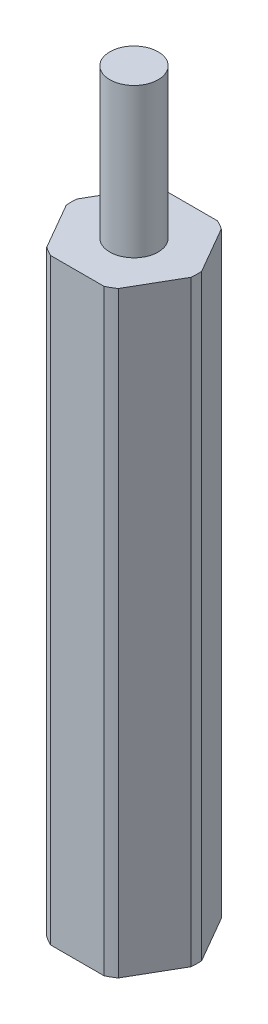
ISO-10303-21;
HEADER;
FILE_DESCRIPTION(('STEP AP214'),'2;1');
FILE_NAME('part.step','',(''),(''),'','','');
FILE_SCHEMA(('AUTOMOTIVE_DESIGN { 1 0 10303 214 1 1 1 1 }'));
ENDSEC;
DATA;
#1=APPLICATION_CONTEXT('core data for automotive mechanical design processes');
#2=APPLICATION_PROTOCOL_DEFINITION('international standard','automotive_design',2000,#1);
#3=PRODUCT_CONTEXT('',#1,'mechanical');
#4=PRODUCT('Part','Part','',(#3));
#5=PRODUCT_RELATED_PRODUCT_CATEGORY('part','',(#4));
#6=PRODUCT_DEFINITION_FORMATION('','',#4);
#7=PRODUCT_DEFINITION_CONTEXT('part definition',#1,'design');
#8=PRODUCT_DEFINITION('design','',#6,#7);
#9=PRODUCT_DEFINITION_SHAPE('','',#8);
#10=(LENGTH_UNIT() NAMED_UNIT(*) SI_UNIT(.MILLI.,.METRE.));
#11=(NAMED_UNIT(*) PLANE_ANGLE_UNIT() SI_UNIT($,.RADIAN.));
#12=(NAMED_UNIT(*) SI_UNIT($,.STERADIAN.) SOLID_ANGLE_UNIT());
#13=UNCERTAINTY_MEASURE_WITH_UNIT(LENGTH_MEASURE(1.E-05),#10,'distance_accuracy_value','');
#14=(GEOMETRIC_REPRESENTATION_CONTEXT(3) GLOBAL_UNCERTAINTY_ASSIGNED_CONTEXT((#13)) GLOBAL_UNIT_ASSIGNED_CONTEXT((#10,
#11,#12)) REPRESENTATION_CONTEXT('',''));
#15=CARTESIAN_POINT('',(0.,0.,0.));
#16=DIRECTION('',(0.,0.,1.));
#17=DIRECTION('',(1.,0.,0.));
#18=AXIS2_PLACEMENT_3D('',#15,#16,#17);
#19=CARTESIAN_POINT('',(0.,25.4,0.));
#20=DIRECTION('',(0.,-1.,0.));
#21=DIRECTION('',(0.,0.,-1.));
#22=AXIS2_PLACEMENT_3D('',#19,#20,#21);
#23=CYLINDRICAL_SURFACE('',#22,2.667);
#24=CARTESIAN_POINT('',(0.,0.,0.));
#25=DIRECTION('',(0.,1.,0.));
#26=DIRECTION('',(0.,0.,1.));
#27=AXIS2_PLACEMENT_3D('',#24,#25,#26);
#28=CIRCLE('',#27,2.667);
#29=CARTESIAN_POINT('',(-1.13592253256989,0.,-2.413));
#30=VERTEX_POINT('',#29);
#31=CARTESIAN_POINT('',(-1.52175803304691,0.,-2.19023776993668));
#32=VERTEX_POINT('',#31);
#33=EDGE_CURVE('E166',#30,#32,#28,.T.);
#34=ORIENTED_EDGE('',*,*,#33,.T.);
#35=DIRECTION('',(0.,-1.,0.));
#36=VECTOR('',#35,1.);
#37=CARTESIAN_POINT('',(-1.52175803304691,25.4,-2.19023776993668));
#38=LINE('',#37,#36);
#39=CARTESIAN_POINT('',(-1.52175803304691,25.4,-2.19023776993668));
#40=VERTEX_POINT('',#39);
#41=EDGE_CURVE('E42',#40,#32,#38,.T.);
#42=ORIENTED_EDGE('',*,*,#41,.F.);
#43=CARTESIAN_POINT('',(0.,25.4,0.));
#44=DIRECTION('',(0.,1.,0.));
#45=DIRECTION('',(0.,0.,1.));
#46=AXIS2_PLACEMENT_3D('',#43,#44,#45);
#47=CIRCLE('',#46,2.667);
#48=CARTESIAN_POINT('',(-1.13592253256989,25.4,-2.413));
#49=VERTEX_POINT('',#48);
#50=EDGE_CURVE('E201',#49,#40,#47,.T.);
#51=ORIENTED_EDGE('',*,*,#50,.F.);
#52=DIRECTION('',(0.,-1.,0.));
#53=VECTOR('',#52,1.);
#54=CARTESIAN_POINT('',(-1.13592253256989,25.4,-2.413));
#55=LINE('',#54,#53);
#56=EDGE_CURVE('E162',#49,#30,#55,.T.);
#57=ORIENTED_EDGE('',*,*,#56,.T.);
#58=EDGE_LOOP('',(#34,#42,#51,#57));
#59=FACE_BOUND('',#58,.T.);
#60=ADVANCED_FACE('F39',(#59),#23,.T.);
#61=CARTESIAN_POINT('',(-2.6576805656168,25.4,-0.222762230063314));
#62=DIRECTION('',(0.866025403784439,0.,0.499999999999999));
#63=DIRECTION('',(0.499999999999999,0.,-0.866025403784439));
#64=AXIS2_PLACEMENT_3D('',#61,#62,#63);
#65=PLANE('',#64);
#66=DIRECTION('',(-0.499999999999999,0.,0.866025403784439));
#67=VECTOR('',#66,1.);
#68=CARTESIAN_POINT('',(-2.6576805656168,0.,-0.222762230063314));
#69=LINE('',#68,#67);
#70=CARTESIAN_POINT('',(-2.6576805656168,0.,-0.222762230063315));
#71=VERTEX_POINT('',#70);
#72=EDGE_CURVE('E170',#32,#71,#69,.T.);
#73=ORIENTED_EDGE('',*,*,#72,.T.);
#74=DIRECTION('',(0.,-1.,0.));
#75=VECTOR('',#74,1.);
#76=CARTESIAN_POINT('',(-2.6576805656168,25.4,-0.222762230063315));
#77=LINE('',#76,#75);
#78=CARTESIAN_POINT('',(-2.6576805656168,25.4,-0.222762230063315));
#79=VERTEX_POINT('',#78);
#80=EDGE_CURVE('E231',#79,#71,#77,.T.);
#81=ORIENTED_EDGE('',*,*,#80,.F.);
#82=DIRECTION('',(-0.499999999999999,0.,0.866025403784439));
#83=VECTOR('',#82,1.);
#84=CARTESIAN_POINT('',(-2.6576805656168,25.4,-0.222762230063314));
#85=LINE('',#84,#83);
#86=EDGE_CURVE('E113',#40,#79,#85,.T.);
#87=ORIENTED_EDGE('',*,*,#86,.F.);
#88=ORIENTED_EDGE('',*,*,#41,.T.);
#89=EDGE_LOOP('',(#73,#81,#87,#88));
#90=FACE_BOUND('',#89,.T.);
#91=ADVANCED_FACE('F239',(#90),#65,.F.);
#92=CARTESIAN_POINT('',(0.,25.4,0.));
#93=DIRECTION('',(0.,-1.,0.));
#94=DIRECTION('',(0.,0.,-1.));
#95=AXIS2_PLACEMENT_3D('',#92,#93,#94);
#96=CYLINDRICAL_SURFACE('',#95,2.667);
#97=CARTESIAN_POINT('',(0.,0.,0.));
#98=DIRECTION('',(0.,1.,0.));
#99=DIRECTION('',(0.,0.,1.));
#100=AXIS2_PLACEMENT_3D('',#97,#98,#99);
#101=CIRCLE('',#100,2.667);
#102=CARTESIAN_POINT('',(-2.6576805656168,0.,0.222762230063318));
#103=VERTEX_POINT('',#102);
#104=EDGE_CURVE('E174',#71,#103,#101,.T.);
#105=ORIENTED_EDGE('',*,*,#104,.T.);
#106=DIRECTION('',(0.,-1.,0.));
#107=VECTOR('',#106,1.);
#108=CARTESIAN_POINT('',(-2.6576805656168,25.4,0.222762230063318));
#109=LINE('',#108,#107);
#110=CARTESIAN_POINT('',(-2.6576805656168,25.4,0.222762230063318));
#111=VERTEX_POINT('',#110);
#112=EDGE_CURVE('E228',#111,#103,#109,.T.);
#113=ORIENTED_EDGE('',*,*,#112,.F.);
#114=CARTESIAN_POINT('',(0.,25.4,0.));
#115=DIRECTION('',(0.,1.,0.));
#116=DIRECTION('',(0.,0.,1.));
#117=AXIS2_PLACEMENT_3D('',#114,#115,#116);
#118=CIRCLE('',#117,2.667);
#119=EDGE_CURVE('E257',#79,#111,#118,.T.);
#120=ORIENTED_EDGE('',*,*,#119,.F.);
#121=ORIENTED_EDGE('',*,*,#80,.T.);
#122=EDGE_LOOP('',(#105,#113,#120,#121));
#123=FACE_BOUND('',#122,.T.);
#124=ADVANCED_FACE('F248',(#123),#96,.T.);
#125=CARTESIAN_POINT('',(-1.5217580330469,25.4,2.19023776993668));
#126=DIRECTION('',(0.866025403784438,0.,-0.5));
#127=DIRECTION('',(-0.500000000000001,0.,-0.866025403784438));
#128=AXIS2_PLACEMENT_3D('',#125,#126,#127);
#129=PLANE('',#128);
#130=DIRECTION('',(0.5,0.,0.866025403784438));
#131=VECTOR('',#130,1.);
#132=CARTESIAN_POINT('',(-1.5217580330469,0.,2.19023776993668));
#133=LINE('',#132,#131);
#134=CARTESIAN_POINT('',(-1.5217580330469,0.,2.19023776993668));
#135=VERTEX_POINT('',#134);
#136=EDGE_CURVE('E177',#103,#135,#133,.T.);
#137=ORIENTED_EDGE('',*,*,#136,.T.);
#138=DIRECTION('',(0.,-1.,0.));
#139=VECTOR('',#138,1.);
#140=CARTESIAN_POINT('',(-1.5217580330469,25.4,2.19023776993668));
#141=LINE('',#140,#139);
#142=CARTESIAN_POINT('',(-1.5217580330469,25.4,2.19023776993668));
#143=VERTEX_POINT('',#142);
#144=EDGE_CURVE('E224',#143,#135,#141,.T.);
#145=ORIENTED_EDGE('',*,*,#144,.F.);
#146=DIRECTION('',(0.5,0.,0.866025403784438));
#147=VECTOR('',#146,1.);
#148=CARTESIAN_POINT('',(-1.5217580330469,25.4,2.19023776993668));
#149=LINE('',#148,#147);
#150=EDGE_CURVE('E253',#111,#143,#149,.T.);
#151=ORIENTED_EDGE('',*,*,#150,.F.);
#152=ORIENTED_EDGE('',*,*,#112,.T.);
#153=EDGE_LOOP('',(#137,#145,#151,#152));
#154=FACE_BOUND('',#153,.T.);
#155=ADVANCED_FACE('F251',(#154),#129,.F.);
#156=CARTESIAN_POINT('',(0.,25.4,0.));
#157=DIRECTION('',(0.,-1.,0.));
#158=DIRECTION('',(0.,0.,-1.));
#159=AXIS2_PLACEMENT_3D('',#156,#157,#158);
#160=CYLINDRICAL_SURFACE('',#159,2.667);
#161=CARTESIAN_POINT('',(0.,0.,0.));
#162=DIRECTION('',(0.,1.,0.));
#163=DIRECTION('',(0.,0.,1.));
#164=AXIS2_PLACEMENT_3D('',#161,#162,#163);
#165=CIRCLE('',#164,2.667);
#166=CARTESIAN_POINT('',(-1.13592253256989,0.,2.413));
#167=VERTEX_POINT('',#166);
#168=EDGE_CURVE('E180',#135,#167,#165,.T.);
#169=ORIENTED_EDGE('',*,*,#168,.T.);
#170=DIRECTION('',(0.,-1.,0.));
#171=VECTOR('',#170,1.);
#172=CARTESIAN_POINT('',(-1.13592253256989,25.4,2.413));
#173=LINE('',#172,#171);
#174=CARTESIAN_POINT('',(-1.13592253256989,25.4,2.413));
#175=VERTEX_POINT('',#174);
#176=EDGE_CURVE('E220',#175,#167,#173,.T.);
#177=ORIENTED_EDGE('',*,*,#176,.F.);
#178=CARTESIAN_POINT('',(0.,25.4,0.));
#179=DIRECTION('',(0.,1.,0.));
#180=DIRECTION('',(0.,0.,1.));
#181=AXIS2_PLACEMENT_3D('',#178,#179,#180);
#182=CIRCLE('',#181,2.667);
#183=EDGE_CURVE('E256',#143,#175,#182,.T.);
#184=ORIENTED_EDGE('',*,*,#183,.F.);
#185=ORIENTED_EDGE('',*,*,#144,.T.);
#186=EDGE_LOOP('',(#169,#177,#184,#185));
#187=FACE_BOUND('',#186,.T.);
#188=ADVANCED_FACE('F294',(#187),#160,.T.);
#189=CARTESIAN_POINT('',(1.13592253256989,25.4,2.413));
#190=DIRECTION('',(0.,0.,-1.));
#191=DIRECTION('',(-1.,0.,0.));
#192=AXIS2_PLACEMENT_3D('',#189,#190,#191);
#193=PLANE('',#192);
#194=DIRECTION('',(1.,0.,0.));
#195=VECTOR('',#194,1.);
#196=CARTESIAN_POINT('',(1.13592253256989,0.,2.413));
#197=LINE('',#196,#195);
#198=CARTESIAN_POINT('',(1.13592253256989,0.,2.413));
#199=VERTEX_POINT('',#198);
#200=EDGE_CURVE('E183',#167,#199,#197,.T.);
#201=ORIENTED_EDGE('',*,*,#200,.T.);
#202=DIRECTION('',(0.,-1.,0.));
#203=VECTOR('',#202,1.);
#204=CARTESIAN_POINT('',(1.13592253256989,25.4,2.413));
#205=LINE('',#204,#203);
#206=CARTESIAN_POINT('',(1.13592253256989,25.4,2.413));
#207=VERTEX_POINT('',#206);
#208=EDGE_CURVE('E216',#207,#199,#205,.T.);
#209=ORIENTED_EDGE('',*,*,#208,.F.);
#210=DIRECTION('',(1.,0.,0.));
#211=VECTOR('',#210,1.);
#212=CARTESIAN_POINT('',(1.13592253256989,25.4,2.413));
#213=LINE('',#212,#211);
#214=EDGE_CURVE('E261',#175,#207,#213,.T.);
#215=ORIENTED_EDGE('',*,*,#214,.F.);
#216=ORIENTED_EDGE('',*,*,#176,.T.);
#217=EDGE_LOOP('',(#201,#209,#215,#216));
#218=FACE_BOUND('',#217,.T.);
#219=ADVANCED_FACE('F291',(#218),#193,.F.);
#220=CARTESIAN_POINT('',(0.,25.4,0.));
#221=DIRECTION('',(0.,-1.,0.));
#222=DIRECTION('',(0.,0.,-1.));
#223=AXIS2_PLACEMENT_3D('',#220,#221,#222);
#224=CYLINDRICAL_SURFACE('',#223,2.667);
#225=CARTESIAN_POINT('',(0.,0.,0.));
#226=DIRECTION('',(0.,1.,0.));
#227=DIRECTION('',(0.,0.,1.));
#228=AXIS2_PLACEMENT_3D('',#225,#226,#227);
#229=CIRCLE('',#228,2.667);
#230=CARTESIAN_POINT('',(1.5217580330469,0.,2.19023776993668));
#231=VERTEX_POINT('',#230);
#232=EDGE_CURVE('E186',#199,#231,#229,.T.);
#233=ORIENTED_EDGE('',*,*,#232,.T.);
#234=DIRECTION('',(0.,-1.,0.));
#235=VECTOR('',#234,1.);
#236=CARTESIAN_POINT('',(1.5217580330469,25.4,2.19023776993668));
#237=LINE('',#236,#235);
#238=CARTESIAN_POINT('',(1.5217580330469,25.4,2.19023776993668));
#239=VERTEX_POINT('',#238);
#240=EDGE_CURVE('E212',#239,#231,#237,.T.);
#241=ORIENTED_EDGE('',*,*,#240,.F.);
#242=CARTESIAN_POINT('',(0.,25.4,0.));
#243=DIRECTION('',(0.,1.,0.));
#244=DIRECTION('',(0.,0.,1.));
#245=AXIS2_PLACEMENT_3D('',#242,#243,#244);
#246=CIRCLE('',#245,2.667);
#247=EDGE_CURVE('E268',#207,#239,#246,.T.);
#248=ORIENTED_EDGE('',*,*,#247,.F.);
#249=ORIENTED_EDGE('',*,*,#208,.T.);
#250=EDGE_LOOP('',(#233,#241,#248,#249));
#251=FACE_BOUND('',#250,.T.);
#252=ADVANCED_FACE('F287',(#251),#224,.T.);
#253=CARTESIAN_POINT('',(2.6576805656168,25.4,0.222762230063316));
#254=DIRECTION('',(-0.866025403784439,0.,-0.5));
#255=DIRECTION('',(-0.5,0.,0.866025403784439));
#256=AXIS2_PLACEMENT_3D('',#253,#254,#255);
#257=PLANE('',#256);
#258=DIRECTION('',(0.5,0.,-0.866025403784439));
#259=VECTOR('',#258,1.);
#260=CARTESIAN_POINT('',(2.6576805656168,0.,0.222762230063316));
#261=LINE('',#260,#259);
#262=CARTESIAN_POINT('',(2.6576805656168,0.,0.222762230063316));
#263=VERTEX_POINT('',#262);
#264=EDGE_CURVE('E189',#231,#263,#261,.T.);
#265=ORIENTED_EDGE('',*,*,#264,.T.);
#266=DIRECTION('',(0.,-1.,0.));
#267=VECTOR('',#266,1.);
#268=CARTESIAN_POINT('',(2.6576805656168,25.4,0.222762230063316));
#269=LINE('',#268,#267);
#270=CARTESIAN_POINT('',(2.6576805656168,25.4,0.222762230063316));
#271=VERTEX_POINT('',#270);
#272=EDGE_CURVE('E208',#271,#263,#269,.T.);
#273=ORIENTED_EDGE('',*,*,#272,.F.);
#274=DIRECTION('',(0.5,0.,-0.866025403784439));
#275=VECTOR('',#274,1.);
#276=CARTESIAN_POINT('',(2.6576805656168,25.4,0.222762230063316));
#277=LINE('',#276,#275);
#278=EDGE_CURVE('E271',#239,#271,#277,.T.);
#279=ORIENTED_EDGE('',*,*,#278,.F.);
#280=ORIENTED_EDGE('',*,*,#240,.T.);
#281=EDGE_LOOP('',(#265,#273,#279,#280));
#282=FACE_BOUND('',#281,.T.);
#283=ADVANCED_FACE('F279',(#282),#257,.F.);
#284=CARTESIAN_POINT('',(0.,25.4,0.));
#285=DIRECTION('',(0.,-1.,0.));
#286=DIRECTION('',(0.,0.,-1.));
#287=AXIS2_PLACEMENT_3D('',#284,#285,#286);
#288=CYLINDRICAL_SURFACE('',#287,2.667);
#289=CARTESIAN_POINT('',(0.,0.,0.));
#290=DIRECTION('',(0.,1.,0.));
#291=DIRECTION('',(0.,0.,1.));
#292=AXIS2_PLACEMENT_3D('',#289,#290,#291);
#293=CIRCLE('',#292,2.667);
#294=CARTESIAN_POINT('',(2.6576805656168,0.,-0.222762230063317));
#295=VERTEX_POINT('',#294);
#296=EDGE_CURVE('E192',#263,#295,#293,.T.);
#297=ORIENTED_EDGE('',*,*,#296,.T.);
#298=DIRECTION('',(0.,-1.,0.));
#299=VECTOR('',#298,1.);
#300=CARTESIAN_POINT('',(2.6576805656168,25.4,-0.222762230063317));
#301=LINE('',#300,#299);
#302=CARTESIAN_POINT('',(2.6576805656168,25.4,-0.222762230063317));
#303=VERTEX_POINT('',#302);
#304=EDGE_CURVE('E155',#303,#295,#301,.T.);
#305=ORIENTED_EDGE('',*,*,#304,.F.);
#306=CARTESIAN_POINT('',(0.,25.4,0.));
#307=DIRECTION('',(0.,1.,0.));
#308=DIRECTION('',(0.,0.,1.));
#309=AXIS2_PLACEMENT_3D('',#306,#307,#308);
#310=CIRCLE('',#309,2.667);
#311=EDGE_CURVE('E144',#271,#303,#310,.T.);
#312=ORIENTED_EDGE('',*,*,#311,.F.);
#313=ORIENTED_EDGE('',*,*,#272,.T.);
#314=EDGE_LOOP('',(#297,#305,#312,#313));
#315=FACE_BOUND('',#314,.T.);
#316=ADVANCED_FACE('F283',(#315),#288,.T.);
#317=CARTESIAN_POINT('',(1.5217580330469,25.4,-2.19023776993668));
#318=DIRECTION('',(-0.866025403784439,0.,0.5));
#319=DIRECTION('',(0.5,0.,0.866025403784439));
#320=AXIS2_PLACEMENT_3D('',#317,#318,#319);
#321=PLANE('',#320);
#322=DIRECTION('',(-0.5,0.,-0.866025403784439));
#323=VECTOR('',#322,1.);
#324=CARTESIAN_POINT('',(1.5217580330469,0.,-2.19023776993668));
#325=LINE('',#324,#323);
#326=CARTESIAN_POINT('',(1.5217580330469,0.,-2.19023776993668));
#327=VERTEX_POINT('',#326);
#328=EDGE_CURVE('E153',#295,#327,#325,.T.);
#329=ORIENTED_EDGE('',*,*,#328,.T.);
#330=DIRECTION('',(0.,-1.,0.));
#331=VECTOR('',#330,1.);
#332=CARTESIAN_POINT('',(1.5217580330469,25.4,-2.19023776993668));
#333=LINE('',#332,#331);
#334=CARTESIAN_POINT('',(1.5217580330469,25.4,-2.19023776993668));
#335=VERTEX_POINT('',#334);
#336=EDGE_CURVE('E150',#335,#327,#333,.T.);
#337=ORIENTED_EDGE('',*,*,#336,.F.);
#338=DIRECTION('',(-0.5,0.,-0.866025403784439));
#339=VECTOR('',#338,1.);
#340=CARTESIAN_POINT('',(1.5217580330469,25.4,-2.19023776993668));
#341=LINE('',#340,#339);
#342=EDGE_CURVE('E138',#303,#335,#341,.T.);
#343=ORIENTED_EDGE('',*,*,#342,.F.);
#344=ORIENTED_EDGE('',*,*,#304,.T.);
#345=EDGE_LOOP('',(#329,#337,#343,#344));
#346=FACE_BOUND('',#345,.T.);
#347=ADVANCED_FACE('F151',(#346),#321,.F.);
#348=CARTESIAN_POINT('',(0.,25.4,0.));
#349=DIRECTION('',(0.,-1.,0.));
#350=DIRECTION('',(0.,0.,-1.));
#351=AXIS2_PLACEMENT_3D('',#348,#349,#350);
#352=CYLINDRICAL_SURFACE('',#351,2.667);
#353=CARTESIAN_POINT('',(0.,0.,0.));
#354=DIRECTION('',(0.,1.,0.));
#355=DIRECTION('',(0.,0.,1.));
#356=AXIS2_PLACEMENT_3D('',#353,#354,#355);
#357=CIRCLE('',#356,2.667);
#358=CARTESIAN_POINT('',(1.13592253256989,0.,-2.413));
#359=VERTEX_POINT('',#358);
#360=EDGE_CURVE('E98',#327,#359,#357,.T.);
#361=ORIENTED_EDGE('',*,*,#360,.T.);
#362=DIRECTION('',(0.,-1.,0.));
#363=VECTOR('',#362,1.);
#364=CARTESIAN_POINT('',(1.13592253256989,25.4,-2.413));
#365=LINE('',#364,#363);
#366=CARTESIAN_POINT('',(1.13592253256989,25.4,-2.413));
#367=VERTEX_POINT('',#366);
#368=EDGE_CURVE('E156',#367,#359,#365,.T.);
#369=ORIENTED_EDGE('',*,*,#368,.F.);
#370=CARTESIAN_POINT('',(0.,25.4,0.));
#371=DIRECTION('',(0.,1.,0.));
#372=DIRECTION('',(0.,0.,1.));
#373=AXIS2_PLACEMENT_3D('',#370,#371,#372);
#374=CIRCLE('',#373,2.667);
#375=EDGE_CURVE('E142',#335,#367,#374,.T.);
#376=ORIENTED_EDGE('',*,*,#375,.F.);
#377=ORIENTED_EDGE('',*,*,#336,.T.);
#378=EDGE_LOOP('',(#361,#369,#376,#377));
#379=FACE_BOUND('',#378,.T.);
#380=ADVANCED_FACE('F158',(#379),#352,.T.);
#381=CARTESIAN_POINT('',(-1.13592253256989,25.4,-2.413));
#382=DIRECTION('',(0.,0.,1.));
#383=DIRECTION('',(1.,0.,0.));
#384=AXIS2_PLACEMENT_3D('',#381,#382,#383);
#385=PLANE('',#384);
#386=DIRECTION('',(-1.,0.,0.));
#387=VECTOR('',#386,1.);
#388=CARTESIAN_POINT('',(-1.13592253256989,0.,-2.413));
#389=LINE('',#388,#387);
#390=EDGE_CURVE('E104',#359,#30,#389,.T.);
#391=ORIENTED_EDGE('',*,*,#390,.T.);
#392=ORIENTED_EDGE('',*,*,#56,.F.);
#393=DIRECTION('',(-1.,0.,0.));
#394=VECTOR('',#393,1.);
#395=CARTESIAN_POINT('',(-1.13592253256989,25.4,-2.413));
#396=LINE('',#395,#394);
#397=EDGE_CURVE('E57',#367,#49,#396,.T.);
#398=ORIENTED_EDGE('',*,*,#397,.F.);
#399=ORIENTED_EDGE('',*,*,#368,.T.);
#400=EDGE_LOOP('',(#391,#392,#398,#399));
#401=FACE_BOUND('',#400,.T.);
#402=ADVANCED_FACE('F368',(#401),#385,.F.);
#403=CARTESIAN_POINT('',(0.,25.4,0.));
#404=DIRECTION('',(0.,1.,0.));
#405=DIRECTION('',(0.,0.,1.));
#406=AXIS2_PLACEMENT_3D('',#403,#404,#405);
#407=PLANE('',#406);
#408=CARTESIAN_POINT('',(0.,25.4,0.));
#409=DIRECTION('',(0.,1.,0.));
#410=DIRECTION('',(0.,0.,1.));
#411=AXIS2_PLACEMENT_3D('',#408,#409,#410);
#412=CIRCLE('',#411,1.0287);
#413=CARTESIAN_POINT('',(0.,25.4,1.0287));
#414=VERTEX_POINT('',#413);
#415=EDGE_CURVE('E11',#414,#414,#412,.T.);
#416=ORIENTED_EDGE('',*,*,#415,.F.);
#417=EDGE_LOOP('',(#416));
#418=FACE_BOUND('',#417,.T.);
#419=ORIENTED_EDGE('',*,*,#50,.T.);
#420=ORIENTED_EDGE('',*,*,#86,.T.);
#421=ORIENTED_EDGE('',*,*,#119,.T.);
#422=ORIENTED_EDGE('',*,*,#150,.T.);
#423=ORIENTED_EDGE('',*,*,#183,.T.);
#424=ORIENTED_EDGE('',*,*,#214,.T.);
#425=ORIENTED_EDGE('',*,*,#247,.T.);
#426=ORIENTED_EDGE('',*,*,#278,.T.);
#427=ORIENTED_EDGE('',*,*,#311,.T.);
#428=ORIENTED_EDGE('',*,*,#342,.T.);
#429=ORIENTED_EDGE('',*,*,#375,.T.);
#430=ORIENTED_EDGE('',*,*,#397,.T.);
#431=EDGE_LOOP('',(#419,#420,#421,#422,#423,#424,#425,#426,#427,#428,#429,#430));
#432=FACE_BOUND('',#431,.T.);
#433=ADVANCED_FACE('F140',(#418,#432),#407,.T.);
#434=CARTESIAN_POINT('',(0.,0.,0.));
#435=DIRECTION('',(0.,1.,0.));
#436=DIRECTION('',(0.,0.,1.));
#437=AXIS2_PLACEMENT_3D('',#434,#435,#436);
#438=PLANE('',#437);
#439=CARTESIAN_POINT('',(0.,0.,0.));
#440=DIRECTION('',(0.,-1.,0.));
#441=DIRECTION('',(0.,0.,-1.));
#442=AXIS2_PLACEMENT_3D('',#439,#440,#441);
#443=CIRCLE('',#442,1.0287);
#444=CARTESIAN_POINT('',(0.,0.,-1.0287));
#445=VERTEX_POINT('',#444);
#446=EDGE_CURVE('E442',#445,#445,#443,.T.);
#447=ORIENTED_EDGE('',*,*,#446,.F.);
#448=EDGE_LOOP('',(#447));
#449=FACE_BOUND('',#448,.T.);
#450=ORIENTED_EDGE('',*,*,#33,.F.);
#451=ORIENTED_EDGE('',*,*,#390,.F.);
#452=ORIENTED_EDGE('',*,*,#360,.F.);
#453=ORIENTED_EDGE('',*,*,#328,.F.);
#454=ORIENTED_EDGE('',*,*,#296,.F.);
#455=ORIENTED_EDGE('',*,*,#264,.F.);
#456=ORIENTED_EDGE('',*,*,#232,.F.);
#457=ORIENTED_EDGE('',*,*,#200,.F.);
#458=ORIENTED_EDGE('',*,*,#168,.F.);
#459=ORIENTED_EDGE('',*,*,#136,.F.);
#460=ORIENTED_EDGE('',*,*,#104,.F.);
#461=ORIENTED_EDGE('',*,*,#72,.F.);
#462=EDGE_LOOP('',(#450,#451,#452,#453,#454,#455,#456,#457,#458,#459,#460,#461));
#463=FACE_BOUND('',#462,.T.);
#464=ADVANCED_FACE('F244',(#449,#463),#438,.F.);
#465=CARTESIAN_POINT('',(0.,31.75,0.));
#466=DIRECTION('',(0.,-1.,0.));
#467=DIRECTION('',(0.,0.,-1.));
#468=AXIS2_PLACEMENT_3D('',#465,#466,#467);
#469=CYLINDRICAL_SURFACE('',#468,1.0287);
#470=CARTESIAN_POINT('',(0.,31.75,0.));
#471=DIRECTION('',(0.,1.,0.));
#472=DIRECTION('',(0.,0.,1.));
#473=AXIS2_PLACEMENT_3D('',#470,#471,#472);
#474=CIRCLE('',#473,1.0287);
#475=CARTESIAN_POINT('',(0.,31.75,1.0287));
#476=VERTEX_POINT('',#475);
#477=EDGE_CURVE('E171',#476,#476,#474,.T.);
#478=ORIENTED_EDGE('',*,*,#477,.F.);
#479=EDGE_LOOP('',(#478));
#480=FACE_BOUND('',#479,.T.);
#481=ORIENTED_EDGE('',*,*,#415,.T.);
#482=EDGE_LOOP('',(#481));
#483=FACE_BOUND('',#482,.T.);
#484=ADVANCED_FACE('F392',(#480,#483),#469,.T.);
#485=CARTESIAN_POINT('',(0.,31.75,0.));
#486=DIRECTION('',(0.,1.,0.));
#487=DIRECTION('',(0.,0.,1.));
#488=AXIS2_PLACEMENT_3D('',#485,#486,#487);
#489=PLANE('',#488);
#490=ORIENTED_EDGE('',*,*,#477,.T.);
#491=EDGE_LOOP('',(#490));
#492=FACE_BOUND('',#491,.T.);
#493=ADVANCED_FACE('F397',(#492),#489,.T.);
#494=CARTESIAN_POINT('',(0.,6.35,0.));
#495=DIRECTION('',(0.,-1.,0.));
#496=DIRECTION('',(0.,0.,-1.));
#497=AXIS2_PLACEMENT_3D('',#494,#495,#496);
#498=CYLINDRICAL_SURFACE('',#497,1.0287);
#499=CARTESIAN_POINT('',(0.,6.35,0.));
#500=DIRECTION('',(0.,-1.,0.));
#501=DIRECTION('',(0.,0.,-1.));
#502=AXIS2_PLACEMENT_3D('',#499,#500,#501);
#503=CIRCLE('',#502,1.0287);
#504=CARTESIAN_POINT('',(0.,6.35,-1.0287));
#505=VERTEX_POINT('',#504);
#506=EDGE_CURVE('E440',#505,#505,#503,.T.);
#507=ORIENTED_EDGE('',*,*,#506,.F.);
#508=EDGE_LOOP('',(#507));
#509=FACE_BOUND('',#508,.T.);
#510=ORIENTED_EDGE('',*,*,#446,.T.);
#511=EDGE_LOOP('',(#510));
#512=FACE_BOUND('',#511,.T.);
#513=ADVANCED_FACE('F407',(#509,#512),#498,.F.);
#514=CARTESIAN_POINT('',(0.,6.35,0.));
#515=DIRECTION('',(0.,-1.,0.));
#516=DIRECTION('',(0.,0.,-1.));
#517=AXIS2_PLACEMENT_3D('',#514,#515,#516);
#518=PLANE('',#517);
#519=ORIENTED_EDGE('',*,*,#506,.T.);
#520=EDGE_LOOP('',(#519));
#521=FACE_BOUND('',#520,.T.);
#522=ADVANCED_FACE('F424',(#521),#518,.T.);
#523=CLOSED_SHELL('',(#60,#91,#124,#155,#188,#219,#252,#283,#316,#347,#380,#402,#433,#464,#484,
#493,#513,#522));
#524=MANIFOLD_SOLID_BREP('B2',#523);
#525=ADVANCED_BREP_SHAPE_REPRESENTATION('',(#18,#524),#14);
#526=SHAPE_DEFINITION_REPRESENTATION(#9,#525);
ENDSEC;
END-ISO-10303-21;
